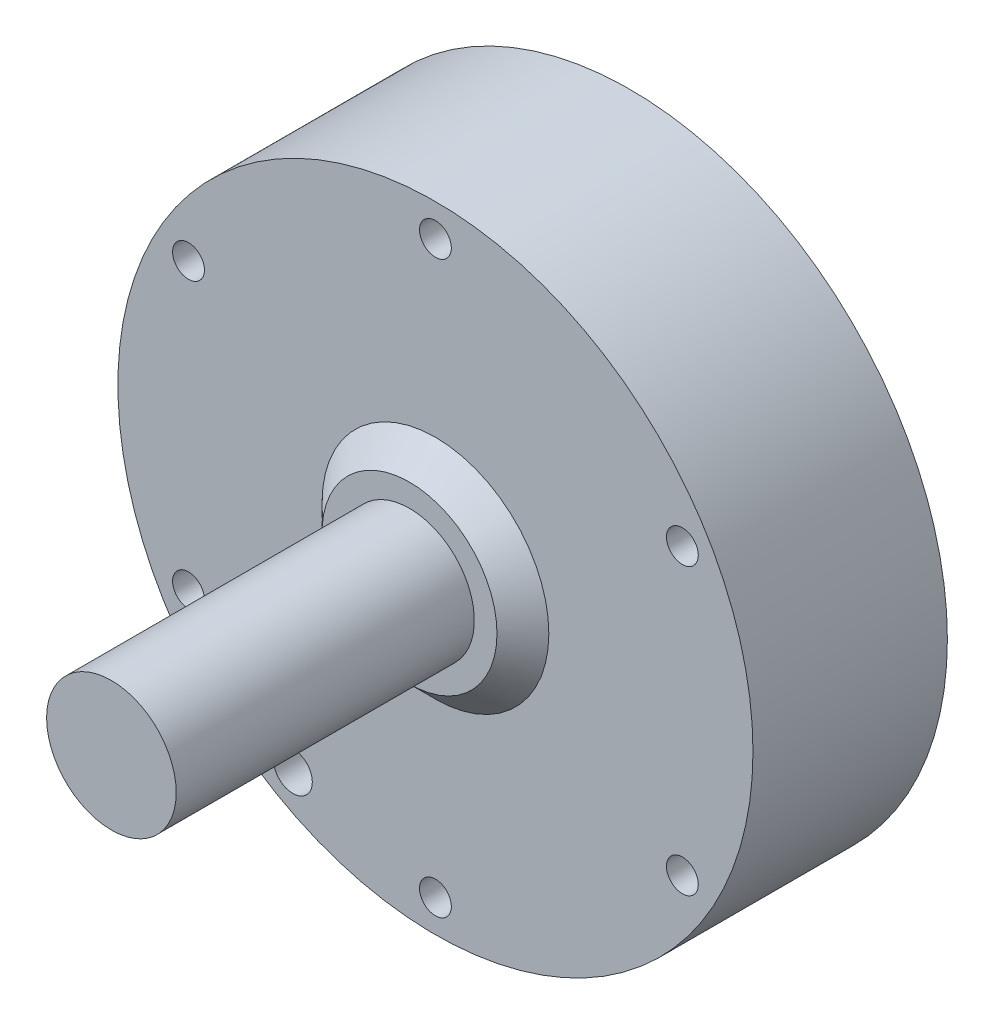
ISO-10303-21;
HEADER;
FILE_DESCRIPTION(('STEP AP214'),'2;1');
FILE_NAME('part.step','',(''),(''),'','','');
FILE_SCHEMA(('AUTOMOTIVE_DESIGN { 1 0 10303 214 1 1 1 1 }'));
ENDSEC;
DATA;
#1=APPLICATION_CONTEXT('core data for automotive mechanical design processes');
#2=APPLICATION_PROTOCOL_DEFINITION('international standard','automotive_design',2000,#1);
#3=PRODUCT_CONTEXT('',#1,'mechanical');
#4=PRODUCT('Part','Part','',(#3));
#5=PRODUCT_RELATED_PRODUCT_CATEGORY('part','',(#4));
#6=PRODUCT_DEFINITION_FORMATION('','',#4);
#7=PRODUCT_DEFINITION_CONTEXT('part definition',#1,'design');
#8=PRODUCT_DEFINITION('design','',#6,#7);
#9=PRODUCT_DEFINITION_SHAPE('','',#8);
#10=(LENGTH_UNIT() NAMED_UNIT(*) SI_UNIT(.MILLI.,.METRE.));
#11=(NAMED_UNIT(*) PLANE_ANGLE_UNIT() SI_UNIT($,.RADIAN.));
#12=(NAMED_UNIT(*) SI_UNIT($,.STERADIAN.) SOLID_ANGLE_UNIT());
#13=UNCERTAINTY_MEASURE_WITH_UNIT(LENGTH_MEASURE(1.E-05),#10,'distance_accuracy_value','');
#14=(GEOMETRIC_REPRESENTATION_CONTEXT(3) GLOBAL_UNCERTAINTY_ASSIGNED_CONTEXT((#13)) GLOBAL_UNIT_ASSIGNED_CONTEXT((#10,
#11,#12)) REPRESENTATION_CONTEXT('',''));
#15=CARTESIAN_POINT('',(0.,0.,0.));
#16=DIRECTION('',(0.,0.,1.));
#17=DIRECTION('',(1.,0.,0.));
#18=AXIS2_PLACEMENT_3D('',#15,#16,#17);
#19=CARTESIAN_POINT('',(0.,0.,30.));
#20=DIRECTION('',(0.,0.,1.));
#21=DIRECTION('',(1.,0.,0.));
#22=AXIS2_PLACEMENT_3D('',#19,#20,#21);
#23=PLANE('',#22);
#24=CARTESIAN_POINT('',(38.1051177665155,21.9999999999996,30.));
#25=DIRECTION('',(0.,0.,1.));
#26=DIRECTION('',(1.,0.,0.));
#27=AXIS2_PLACEMENT_3D('',#24,#25,#26);
#28=CIRCLE('',#27,2.455);
#29=CARTESIAN_POINT('',(40.5601177665155,21.9999999999996,30.));
#30=VERTEX_POINT('',#29);
#31=EDGE_CURVE('E123',#30,#30,#28,.T.);
#32=ORIENTED_EDGE('',*,*,#31,.F.);
#33=EDGE_LOOP('',(#32));
#34=FACE_BOUND('',#33,.T.);
#35=CARTESIAN_POINT('',(-38.1051177665152,22.0000000000002,30.));
#36=DIRECTION('',(0.,0.,1.));
#37=DIRECTION('',(1.,0.,0.));
#38=AXIS2_PLACEMENT_3D('',#35,#36,#37);
#39=CIRCLE('',#38,2.455);
#40=CARTESIAN_POINT('',(-35.6501177665152,22.0000000000002,30.));
#41=VERTEX_POINT('',#40);
#42=EDGE_CURVE('E135',#41,#41,#39,.T.);
#43=ORIENTED_EDGE('',*,*,#42,.F.);
#44=EDGE_LOOP('',(#43));
#45=FACE_BOUND('',#44,.T.);
#46=CARTESIAN_POINT('',(0.,-44.,30.));
#47=DIRECTION('',(0.,0.,1.));
#48=DIRECTION('',(1.,0.,0.));
#49=AXIS2_PLACEMENT_3D('',#46,#47,#48);
#50=CIRCLE('',#49,2.455);
#51=CARTESIAN_POINT('',(2.45499999999999,-44.,30.));
#52=VERTEX_POINT('',#51);
#53=EDGE_CURVE('E147',#52,#52,#50,.T.);
#54=ORIENTED_EDGE('',*,*,#53,.F.);
#55=EDGE_LOOP('',(#54));
#56=FACE_BOUND('',#55,.T.);
#57=CARTESIAN_POINT('',(-22.,-38.1051177665153,30.));
#58=DIRECTION('',(0.,0.,1.));
#59=DIRECTION('',(1.,0.,0.));
#60=AXIS2_PLACEMENT_3D('',#57,#58,#59);
#61=CIRCLE('',#60,3.);
#62=CARTESIAN_POINT('',(-19.0000000000001,-38.1051177665153,30.));
#63=VERTEX_POINT('',#62);
#64=EDGE_CURVE('E153',#63,#63,#61,.T.);
#65=ORIENTED_EDGE('',*,*,#64,.F.);
#66=EDGE_LOOP('',(#65));
#67=FACE_BOUND('',#66,.T.);
#68=CARTESIAN_POINT('',(0.,0.,30.));
#69=DIRECTION('',(0.,0.,1.));
#70=DIRECTION('',(1.,0.,0.));
#71=AXIS2_PLACEMENT_3D('',#68,#69,#70);
#72=CIRCLE('',#71,49.);
#73=CARTESIAN_POINT('',(49.,0.,30.));
#74=VERTEX_POINT('',#73);
#75=EDGE_CURVE('E172',#74,#74,#72,.T.);
#76=ORIENTED_EDGE('',*,*,#75,.T.);
#77=EDGE_LOOP('',(#76));
#78=FACE_BOUND('',#77,.T.);
#79=CARTESIAN_POINT('',(0.,0.,30.));
#80=DIRECTION('',(0.,0.,1.));
#81=DIRECTION('',(1.,0.,0.));
#82=AXIS2_PLACEMENT_3D('',#79,#80,#81);
#83=CIRCLE('',#82,17.5);
#84=CARTESIAN_POINT('',(17.5,0.,30.));
#85=VERTEX_POINT('',#84);
#86=EDGE_CURVE('E168',#85,#85,#83,.T.);
#87=ORIENTED_EDGE('',*,*,#86,.F.);
#88=EDGE_LOOP('',(#87));
#89=FACE_BOUND('',#88,.T.);
#90=CARTESIAN_POINT('',(-38.1051177665154,-21.9999999999999,30.));
#91=DIRECTION('',(0.,0.,1.));
#92=DIRECTION('',(1.,0.,0.));
#93=AXIS2_PLACEMENT_3D('',#90,#91,#92);
#94=CIRCLE('',#93,2.455);
#95=CARTESIAN_POINT('',(-35.6501177665154,-21.9999999999999,30.));
#96=VERTEX_POINT('',#95);
#97=EDGE_CURVE('E141',#96,#96,#94,.T.);
#98=ORIENTED_EDGE('',*,*,#97,.F.);
#99=EDGE_LOOP('',(#98));
#100=FACE_BOUND('',#99,.T.);
#101=CARTESIAN_POINT('',(3.14577829780722E-13,44.,30.));
#102=DIRECTION('',(0.,0.,1.));
#103=DIRECTION('',(1.,0.,0.));
#104=AXIS2_PLACEMENT_3D('',#101,#102,#103);
#105=CIRCLE('',#104,2.455);
#106=CARTESIAN_POINT('',(2.45500000000031,44.,30.));
#107=VERTEX_POINT('',#106);
#108=EDGE_CURVE('E129',#107,#107,#105,.T.);
#109=ORIENTED_EDGE('',*,*,#108,.F.);
#110=EDGE_LOOP('',(#109));
#111=FACE_BOUND('',#110,.T.);
#112=CARTESIAN_POINT('',(38.105117766515,-22.0000000000005,30.));
#113=DIRECTION('',(0.,0.,1.));
#114=DIRECTION('',(1.,0.,0.));
#115=AXIS2_PLACEMENT_3D('',#112,#113,#114);
#116=CIRCLE('',#115,2.455);
#117=CARTESIAN_POINT('',(40.560117766515,-22.0000000000005,30.));
#118=VERTEX_POINT('',#117);
#119=EDGE_CURVE('E117',#118,#118,#116,.T.);
#120=ORIENTED_EDGE('',*,*,#119,.F.);
#121=EDGE_LOOP('',(#120));
#122=FACE_BOUND('',#121,.T.);
#123=ADVANCED_FACE('F36',(#34,#45,#56,#67,#78,#89,#100,#111,#122),#23,.T.);
#124=CARTESIAN_POINT('',(0.,13.5,34.));
#125=DIRECTION('',(0.,0.,-1.));
#126=DIRECTION('',(-1.,0.,0.));
#127=AXIS2_PLACEMENT_3D('',#124,#125,#126);
#128=PLANE('',#127);
#129=CARTESIAN_POINT('',(0.,0.,34.));
#130=DIRECTION('',(0.,0.,1.));
#131=DIRECTION('',(1.,0.,0.));
#132=AXIS2_PLACEMENT_3D('',#129,#130,#131);
#133=CIRCLE('',#132,13.5);
#134=CARTESIAN_POINT('',(13.5,0.,34.));
#135=VERTEX_POINT('',#134);
#136=EDGE_CURVE('E165',#135,#135,#133,.T.);
#137=ORIENTED_EDGE('',*,*,#136,.T.);
#138=EDGE_LOOP('',(#137));
#139=FACE_BOUND('',#138,.T.);
#140=CARTESIAN_POINT('',(0.,0.,34.));
#141=DIRECTION('',(0.,0.,-1.));
#142=DIRECTION('',(-1.,0.,0.));
#143=AXIS2_PLACEMENT_3D('',#140,#141,#142);
#144=CIRCLE('',#143,10.);
#145=CARTESIAN_POINT('',(-10.,0.,34.));
#146=VERTEX_POINT('',#145);
#147=EDGE_CURVE('E11',#146,#146,#144,.F.);
#148=ORIENTED_EDGE('',*,*,#147,.F.);
#149=EDGE_LOOP('',(#148));
#150=FACE_BOUND('',#149,.T.);
#151=ADVANCED_FACE('F189',(#139,#150),#128,.F.);
#152=CARTESIAN_POINT('',(0.,0.,30.));
#153=DIRECTION('',(0.,0.,-1.));
#154=DIRECTION('',(-1.,0.,0.));
#155=AXIS2_PLACEMENT_3D('',#152,#153,#154);
#156=CYLINDRICAL_SURFACE('',#155,49.);
#157=CARTESIAN_POINT('',(-49.,0.,21.));
#158=CARTESIAN_POINT('',(-48.9999987782611,-0.168342132239242,20.9999925903546));
#159=CARTESIAN_POINT('',(-48.9991231981665,-0.336802306195177,20.9857828521781));
#160=CARTESIAN_POINT('',(-48.9957145124218,-0.669071574623784,20.9293010732423));
#161=CARTESIAN_POINT('',(-48.9931794749463,-0.832875015867812,20.886996325384));
#162=CARTESIAN_POINT('',(-48.9867386712462,-1.1509697533479,20.775543736485));
#163=CARTESIAN_POINT('',(-48.9828336254435,-1.3052659989282,20.706410001503));
#164=CARTESIAN_POINT('',(-48.9740920800564,-1.60002336933338,20.5432846263633));
#165=CARTESIAN_POINT('',(-48.9692557945962,-1.74048766340163,20.4492986987323));
#166=CARTESIAN_POINT('',(-48.9591876344111,-2.00383706595997,20.2389880206162));
#167=CARTESIAN_POINT('',(-48.9539552645477,-2.12669959703624,20.1226350202509));
#168=CARTESIAN_POINT('',(-48.943688885261,-2.35116484417934,19.8709510932809));
#169=CARTESIAN_POINT('',(-48.9386548841123,-2.45276667414156,19.7356193760727));
#170=CARTESIAN_POINT('',(-48.9293491416637,-2.63189536608893,19.4496925321437));
#171=CARTESIAN_POINT('',(-48.9250779923096,-2.7094035665099,19.2990856933228));
#172=CARTESIAN_POINT('',(-48.9177859887818,-2.83802538849686,18.9869659222724));
#173=CARTESIAN_POINT('',(-48.9147651216073,-2.88913928451839,18.8254531034661));
#174=CARTESIAN_POINT('',(-48.9103190415616,-2.96345914981416,18.4963228276852));
#175=CARTESIAN_POINT('',(-48.908891814127,-2.98670035647312,18.3287133552047));
#176=CARTESIAN_POINT('',(-48.9077879273528,-3.00472388165541,17.9919665455956));
#177=CARTESIAN_POINT('',(-48.9081112488621,-2.99950651151652,17.8228292252021));
#178=CARTESIAN_POINT('',(-48.9104701284996,-2.96079023817325,17.4880679480226));
#179=CARTESIAN_POINT('',(-48.9125033784114,-2.92732946025551,17.3224395633948));
#180=CARTESIAN_POINT('',(-48.9180493413292,-2.83313532919725,16.9991548213024));
#181=CARTESIAN_POINT('',(-48.9215620629073,-2.77240181803547,16.8414985100349));
#182=CARTESIAN_POINT('',(-48.9296737585873,-2.62534291212242,16.5385106805562));
#183=CARTESIAN_POINT('',(-48.9342734667511,-2.53900021292164,16.3931875817226));
#184=CARTESIAN_POINT('',(-48.9440400332174,-2.34318643121859,16.1190834190871));
#185=CARTESIAN_POINT('',(-48.9492068976297,-2.23371509955261,15.9903025335176));
#186=CARTESIAN_POINT('',(-48.9595357461034,-1.99453676722566,15.7527165848546));
#187=CARTESIAN_POINT('',(-48.9646977081483,-1.86479676908493,15.643944736669));
#188=CARTESIAN_POINT('',(-48.9744268496561,-1.58887965822355,15.4497206706382));
#189=CARTESIAN_POINT('',(-48.9789940289189,-1.44270253997375,15.3642684606375));
#190=CARTESIAN_POINT('',(-48.9870192872341,-1.13804055781479,15.2191122003982));
#191=CARTESIAN_POINT('',(-48.9904773125742,-0.979555098318889,15.1594093970617));
#192=CARTESIAN_POINT('',(-48.9958938572066,-0.654784212144267,15.067468828864));
#193=CARTESIAN_POINT('',(-48.9978523933052,-0.488498872909138,15.0352307561763));
#194=CARTESIAN_POINT('',(-49.0000470940588,-0.153136661949562,14.999175902475));
#195=CARTESIAN_POINT('',(-49.0002860418123,0.0159352549807618,14.9953131966331));
#196=CARTESIAN_POINT('',(-48.9990220406461,0.352324652623047,15.0159987466675));
#197=CARTESIAN_POINT('',(-48.9975191004198,0.519642142086703,15.0405468607525));
#198=CARTESIAN_POINT('',(-48.9929423179814,0.847643855794574,15.1173191955916));
#199=CARTESIAN_POINT('',(-48.9898696711438,1.0083330271957,15.1695223573864));
#200=CARTESIAN_POINT('',(-48.9824991874776,1.31866938728175,15.30010154663));
#201=CARTESIAN_POINT('',(-48.9782013400714,1.4683164806224,15.3784778000414));
#202=CARTESIAN_POINT('',(-48.9688565067312,1.75253112004625,15.5592953401906));
#203=CARTESIAN_POINT('',(-48.9638085686364,1.88707911273342,15.6617673116271));
#204=CARTESIAN_POINT('',(-48.9535348807093,2.13707941317929,15.8878228018194));
#205=CARTESIAN_POINT('',(-48.9483091291954,2.25253154028778,16.0114065202734));
#206=CARTESIAN_POINT('',(-48.9382607488204,2.46121830716684,16.2763754871246));
#207=CARTESIAN_POINT('',(-48.9334386659401,2.55442316192653,16.417784217407));
#208=CARTESIAN_POINT('',(-48.9247500925023,2.71576591909967,16.71427103936));
#209=CARTESIAN_POINT('',(-48.9208835962452,2.78390397102339,16.8693490494938));
#210=CARTESIAN_POINT('',(-48.9145461606989,2.89312731704894,17.1886633685796));
#211=CARTESIAN_POINT('',(-48.9120742531065,2.93423138492115,17.352893235863));
#212=CARTESIAN_POINT('',(-48.9088020649113,2.98828129316026,17.6859389442547));
#213=CARTESIAN_POINT('',(-48.9080017685169,3.00122739953276,17.8547547420247));
#214=CARTESIAN_POINT('',(-48.9081634349173,2.99859133925077,18.191884052363));
#215=CARTESIAN_POINT('',(-48.9091225049361,2.98305600222657,18.3601979344897));
#216=CARTESIAN_POINT('',(-48.9126886992029,2.92399510479369,18.691822606684));
#217=CARTESIAN_POINT('',(-48.9152958264563,2.88046949334117,18.8551333876272));
#218=CARTESIAN_POINT('',(-48.9218636280755,2.76667402075177,19.1721234119009));
#219=CARTESIAN_POINT('',(-48.925824295324,2.69640430024134,19.325802705871));
#220=CARTESIAN_POINT('',(-48.9346527620099,2.53112189857519,19.619187929208));
#221=CARTESIAN_POINT('',(-48.9395205374642,2.43610987155502,19.758894227857));
#222=CARTESIAN_POINT('',(-48.94962397496,2.22386722657035,20.0206048811718));
#223=CARTESIAN_POINT('',(-48.9548601881662,2.10660285562631,20.1425818405755));
#224=CARTESIAN_POINT('',(-48.9651058168507,1.85322764074876,20.3651606586719));
#225=CARTESIAN_POINT('',(-48.9701151764916,1.71711218994053,20.4657572771047));
#226=CARTESIAN_POINT('',(-48.9793476296826,1.42974910005197,20.6427908622421));
#227=CARTESIAN_POINT('',(-48.9835697680307,1.27848341547059,20.7191985558979));
#228=CARTESIAN_POINT('',(-48.9907390581765,0.965354874405892,20.8454388842453));
#229=CARTESIAN_POINT('',(-48.9936877038608,0.803504692350495,20.8953026726621));
#230=CARTESIAN_POINT('',(-48.9972042527984,0.533885495324568,20.9540663865922));
#231=CARTESIAN_POINT('',(-48.9982480044745,0.427859687374557,20.9712692498115));
#232=CARTESIAN_POINT('',(-48.9996462670196,0.214571907055574,20.9942384106042));
#233=CARTESIAN_POINT('',(-49.0000007787992,0.107309936320186,21.0000047232892));
#234=CARTESIAN_POINT('',(-49.,0.,21.));
#235=B_SPLINE_CURVE_WITH_KNOTS('',3,(#157,#158,#159,#160,#161,#162,#163,#164,#165,#166,#167,
#168,#169,#170,#171,#172,#173,#174,#175,#176,#177,#178,#179,#180,#181,#182,#183,#184,#185,#186,
#187,#188,#189,#190,#191,#192,#193,#194,#195,#196,#197,#198,#199,#200,#201,#202,#203,#204,#205,
#206,#207,#208,#209,#210,#211,#212,#213,#214,#215,#216,#217,#218,#219,#220,#221,#222,#223,#224,
#225,#226,#227,#228,#229,#230,#231,#232,#233,#234),.UNSPECIFIED.,.T.,.F.,(4,2,2,2,2,2,2,2,2,2,2,
2,2,2,2,2,2,2,2,2,2,2,2,2,2,2,2,2,2,2,2,2,2,2,2,2,2,2,4),(0.,0.504634654396564,1.00985781674203,
1.51481570358409,2.01965762151657,2.52514140060477,3.03064624307793,3.53654165104006,
4.04243179845081,4.54768170979437,5.05292609369829,5.55748954567153,6.0620559211797,
6.56696401827817,7.07187755500635,7.57762182785094,8.08336627081969,8.58913520145787,
9.09489846333091,9.59984297917681,10.104784974984,10.6093430155595,11.1139054122984,
11.619113857539,12.1243270818661,12.6302129469633,13.1360957946689,13.6416269596658,
14.1471533489368,14.6518492892306,15.1565461499046,15.6612403568073,16.1659212219903,
16.6713738104314,17.1769501413444,17.6831359942207,18.1887264358806,18.5104069531811,
18.8320870454309),.UNSPECIFIED.);
#236=CARTESIAN_POINT('',(-49.,0.,21.));
#237=VERTEX_POINT('',#236);
#238=EDGE_CURVE('E45',#237,#237,#235,.T.);
#239=ORIENTED_EDGE('',*,*,#238,.T.);
#240=EDGE_LOOP('',(#239));
#241=FACE_BOUND('',#240,.T.);
#242=ORIENTED_EDGE('',*,*,#75,.F.);
#243=EDGE_LOOP('',(#242));
#244=FACE_BOUND('',#243,.T.);
#245=CARTESIAN_POINT('',(0.,0.,0.));
#246=DIRECTION('',(0.,0.,1.));
#247=DIRECTION('',(1.,0.,0.));
#248=AXIS2_PLACEMENT_3D('',#245,#246,#247);
#249=CIRCLE('',#248,49.);
#250=CARTESIAN_POINT('',(49.,0.,0.));
#251=VERTEX_POINT('',#250);
#252=EDGE_CURVE('E171',#251,#251,#249,.T.);
#253=ORIENTED_EDGE('',*,*,#252,.T.);
#254=EDGE_LOOP('',(#253));
#255=FACE_BOUND('',#254,.T.);
#256=ADVANCED_FACE('F38',(#241,#244,#255),#156,.T.);
#257=CARTESIAN_POINT('',(0.,0.,0.));
#258=DIRECTION('',(0.,0.,1.));
#259=DIRECTION('',(1.,0.,0.));
#260=AXIS2_PLACEMENT_3D('',#257,#258,#259);
#261=PLANE('',#260);
#262=CARTESIAN_POINT('',(15.0439813274521,-25.9553694822894,0.));
#263=DIRECTION('',(0.,0.,-1.));
#264=DIRECTION('',(-1.,0.,0.));
#265=AXIS2_PLACEMENT_3D('',#262,#263,#264);
#266=CIRCLE('',#265,2.5);
#267=CARTESIAN_POINT('',(12.5439813274521,-25.9553694822894,0.));
#268=VERTEX_POINT('',#267);
#269=EDGE_CURVE('E88',#268,#268,#266,.T.);
#270=ORIENTED_EDGE('',*,*,#269,.F.);
#271=EDGE_LOOP('',(#270));
#272=FACE_BOUND('',#271,.T.);
#273=CARTESIAN_POINT('',(14.9560186725478,26.006154744777,0.));
#274=DIRECTION('',(0.,0.,-1.));
#275=DIRECTION('',(-1.,0.,0.));
#276=AXIS2_PLACEMENT_3D('',#273,#274,#275);
#277=CIRCLE('',#276,2.5);
#278=CARTESIAN_POINT('',(12.4560186725478,26.006154744777,0.));
#279=VERTEX_POINT('',#278);
#280=EDGE_CURVE('E96',#279,#279,#277,.T.);
#281=ORIENTED_EDGE('',*,*,#280,.F.);
#282=EDGE_LOOP('',(#281));
#283=FACE_BOUND('',#282,.T.);
#284=CARTESIAN_POINT('',(-30.,-0.0507852624878061,0.));
#285=DIRECTION('',(0.,0.,-1.));
#286=DIRECTION('',(-1.,0.,0.));
#287=AXIS2_PLACEMENT_3D('',#284,#285,#286);
#288=CIRCLE('',#287,2.5);
#289=CARTESIAN_POINT('',(-32.5,-0.0507852624878061,0.));
#290=VERTEX_POINT('',#289);
#291=EDGE_CURVE('E102',#290,#290,#288,.T.);
#292=ORIENTED_EDGE('',*,*,#291,.F.);
#293=EDGE_LOOP('',(#292));
#294=FACE_BOUND('',#293,.T.);
#295=CARTESIAN_POINT('',(29.9999722931035,0.0407726994683093,0.));
#296=DIRECTION('',(0.,0.,-1.));
#297=DIRECTION('',(0.707106781186551,0.707106781186544,0.));
#298=AXIS2_PLACEMENT_3D('',#295,#296,#297);
#299=CIRCLE('',#298,3.);
#300=CARTESIAN_POINT('',(32.1212926366632,2.16209304302794,0.));
#301=VERTEX_POINT('',#300);
#302=EDGE_CURVE('E105',#301,#301,#299,.T.);
#303=ORIENTED_EDGE('',*,*,#302,.F.);
#304=EDGE_LOOP('',(#303));
#305=FACE_BOUND('',#304,.T.);
#306=CARTESIAN_POINT('',(-21.2420144961435,21.1843531915806,0.));
#307=DIRECTION('',(0.,0.,-1.));
#308=DIRECTION('',(-1.,0.,0.));
#309=AXIS2_PLACEMENT_3D('',#306,#307,#308);
#310=CIRCLE('',#309,3.);
#311=CARTESIAN_POINT('',(-24.2420144961435,21.1843531915806,0.));
#312=VERTEX_POINT('',#311);
#313=EDGE_CURVE('E114',#312,#312,#310,.T.);
#314=ORIENTED_EDGE('',*,*,#313,.F.);
#315=EDGE_LOOP('',(#314));
#316=FACE_BOUND('',#315,.T.);
#317=CARTESIAN_POINT('',(-22.,-38.1051177665153,0.));
#318=DIRECTION('',(0.,0.,1.));
#319=DIRECTION('',(1.,0.,0.));
#320=AXIS2_PLACEMENT_3D('',#317,#318,#319);
#321=CIRCLE('',#320,3.);
#322=CARTESIAN_POINT('',(-19.0000000000001,-38.1051177665153,0.));
#323=VERTEX_POINT('',#322);
#324=EDGE_CURVE('E154',#323,#323,#321,.T.);
#325=ORIENTED_EDGE('',*,*,#324,.T.);
#326=EDGE_LOOP('',(#325));
#327=FACE_BOUND('',#326,.T.);
#328=ORIENTED_EDGE('',*,*,#252,.F.);
#329=EDGE_LOOP('',(#328));
#330=FACE_BOUND('',#329,.T.);
#331=ADVANCED_FACE('F195',(#272,#283,#294,#305,#316,#327,#330),#261,.F.);
#332=CARTESIAN_POINT('',(0.,0.,30.));
#333=DIRECTION('',(0.,0.,-1.));
#334=DIRECTION('',(-1.,0.,0.));
#335=AXIS2_PLACEMENT_3D('',#332,#333,#334);
#336=CONICAL_SURFACE('',#335,17.5,0.785398163397446);
#337=ORIENTED_EDGE('',*,*,#136,.F.);
#338=EDGE_LOOP('',(#337));
#339=FACE_BOUND('',#338,.T.);
#340=ORIENTED_EDGE('',*,*,#86,.T.);
#341=EDGE_LOOP('',(#340));
#342=FACE_BOUND('',#341,.T.);
#343=ADVANCED_FACE('F186',(#339,#342),#336,.T.);
#344=CARTESIAN_POINT('',(-37.,0.,18.));
#345=DIRECTION('',(-1.,0.,0.));
#346=DIRECTION('',(0.,0.,1.));
#347=AXIS2_PLACEMENT_3D('',#344,#345,#346);
#348=CYLINDRICAL_SURFACE('',#347,3.);
#349=CARTESIAN_POINT('',(-37.,0.,18.));
#350=DIRECTION('',(-1.,0.,0.));
#351=DIRECTION('',(0.,0.,1.));
#352=AXIS2_PLACEMENT_3D('',#349,#350,#351);
#353=CIRCLE('',#352,3.);
#354=CARTESIAN_POINT('',(-37.,0.,21.));
#355=VERTEX_POINT('',#354);
#356=EDGE_CURVE('E162',#355,#355,#353,.T.);
#357=ORIENTED_EDGE('',*,*,#356,.F.);
#358=EDGE_LOOP('',(#357));
#359=FACE_BOUND('',#358,.T.);
#360=ORIENTED_EDGE('',*,*,#238,.F.);
#361=EDGE_LOOP('',(#360));
#362=FACE_BOUND('',#361,.T.);
#363=ADVANCED_FACE('F180',(#359,#362),#348,.F.);
#364=CARTESIAN_POINT('',(-37.,0.,18.));
#365=DIRECTION('',(-1.,0.,0.));
#366=DIRECTION('',(0.,0.,1.));
#367=AXIS2_PLACEMENT_3D('',#364,#365,#366);
#368=PLANE('',#367);
#369=ORIENTED_EDGE('',*,*,#356,.T.);
#370=EDGE_LOOP('',(#369));
#371=FACE_BOUND('',#370,.T.);
#372=ADVANCED_FACE('F185',(#371),#368,.T.);
#373=CARTESIAN_POINT('',(0.,0.,80.));
#374=DIRECTION('',(0.,0.,-1.));
#375=DIRECTION('',(-1.,0.,0.));
#376=AXIS2_PLACEMENT_3D('',#373,#374,#375);
#377=CYLINDRICAL_SURFACE('',#376,10.);
#378=CARTESIAN_POINT('',(0.,0.,80.));
#379=DIRECTION('',(0.,0.,1.));
#380=DIRECTION('',(1.,0.,0.));
#381=AXIS2_PLACEMENT_3D('',#378,#379,#380);
#382=CIRCLE('',#381,10.);
#383=CARTESIAN_POINT('',(10.,0.,80.));
#384=VERTEX_POINT('',#383);
#385=EDGE_CURVE('E157',#384,#384,#382,.T.);
#386=ORIENTED_EDGE('',*,*,#385,.F.);
#387=EDGE_LOOP('',(#386));
#388=FACE_BOUND('',#387,.T.);
#389=ORIENTED_EDGE('',*,*,#147,.T.);
#390=EDGE_LOOP('',(#389));
#391=FACE_BOUND('',#390,.T.);
#392=ADVANCED_FACE('F294',(#388,#391),#377,.T.);
#393=CARTESIAN_POINT('',(0.,0.,80.));
#394=DIRECTION('',(0.,0.,1.));
#395=DIRECTION('',(1.,0.,0.));
#396=AXIS2_PLACEMENT_3D('',#393,#394,#395);
#397=PLANE('',#396);
#398=ORIENTED_EDGE('',*,*,#385,.T.);
#399=EDGE_LOOP('',(#398));
#400=FACE_BOUND('',#399,.T.);
#401=ADVANCED_FACE('F224',(#400),#397,.T.);
#402=CARTESIAN_POINT('',(-22.,-38.1051177665153,0.));
#403=DIRECTION('',(0.,0.,1.));
#404=DIRECTION('',(1.,0.,0.));
#405=AXIS2_PLACEMENT_3D('',#402,#403,#404);
#406=CYLINDRICAL_SURFACE('',#405,3.);
#407=ORIENTED_EDGE('',*,*,#324,.F.);
#408=EDGE_LOOP('',(#407));
#409=FACE_BOUND('',#408,.T.);
#410=ORIENTED_EDGE('',*,*,#64,.T.);
#411=EDGE_LOOP('',(#410));
#412=FACE_BOUND('',#411,.T.);
#413=ADVANCED_FACE('F220',(#409,#412),#406,.F.);
#414=CARTESIAN_POINT('',(0.,-44.,3.52488718028734));
#415=DIRECTION('',(0.,0.,1.));
#416=DIRECTION('',(1.,0.,0.));
#417=AXIS2_PLACEMENT_3D('',#414,#415,#416);
#418=CONICAL_SURFACE('',#417,0.,1.02974425867666);
#419=CARTESIAN_POINT('',(0.,-44.,5.));
#420=DIRECTION('',(0.,0.,1.));
#421=DIRECTION('',(1.,0.,0.));
#422=AXIS2_PLACEMENT_3D('',#419,#420,#421);
#423=CIRCLE('',#422,2.455);
#424=CARTESIAN_POINT('',(2.45499999999999,-44.,5.));
#425=VERTEX_POINT('',#424);
#426=EDGE_CURVE('E150',#425,#425,#423,.T.);
#427=ORIENTED_EDGE('',*,*,#426,.T.);
#428=EDGE_LOOP('',(#427));
#429=FACE_BOUND('',#428,.T.);
#430=CARTESIAN_POINT('',(0.,-44.,3.52488718028734));
#431=VERTEX_POINT('',#430);
#432=VERTEX_LOOP('',#431);
#433=FACE_BOUND('',#432,.T.);
#434=ADVANCED_FACE('F223',(#429,#433),#418,.F.);
#435=CARTESIAN_POINT('',(0.,-44.,30.));
#436=DIRECTION('',(0.,0.,1.));
#437=DIRECTION('',(1.,0.,0.));
#438=AXIS2_PLACEMENT_3D('',#435,#436,#437);
#439=CYLINDRICAL_SURFACE('',#438,2.455);
#440=ORIENTED_EDGE('',*,*,#53,.T.);
#441=EDGE_LOOP('',(#440));
#442=FACE_BOUND('',#441,.T.);
#443=ORIENTED_EDGE('',*,*,#426,.F.);
#444=EDGE_LOOP('',(#443));
#445=FACE_BOUND('',#444,.T.);
#446=ADVANCED_FACE('F285',(#442,#445),#439,.F.);
#447=CARTESIAN_POINT('',(-38.1051177665154,-21.9999999999999,3.52488718028734));
#448=DIRECTION('',(0.,0.,1.));
#449=DIRECTION('',(1.,0.,0.));
#450=AXIS2_PLACEMENT_3D('',#447,#448,#449);
#451=CONICAL_SURFACE('',#450,0.,1.02974425867666);
#452=CARTESIAN_POINT('',(-38.1051177665154,-21.9999999999999,5.));
#453=DIRECTION('',(0.,0.,1.));
#454=DIRECTION('',(1.,0.,0.));
#455=AXIS2_PLACEMENT_3D('',#452,#453,#454);
#456=CIRCLE('',#455,2.455);
#457=CARTESIAN_POINT('',(-35.6501177665154,-21.9999999999999,5.));
#458=VERTEX_POINT('',#457);
#459=EDGE_CURVE('E144',#458,#458,#456,.T.);
#460=ORIENTED_EDGE('',*,*,#459,.T.);
#461=EDGE_LOOP('',(#460));
#462=FACE_BOUND('',#461,.T.);
#463=CARTESIAN_POINT('',(-38.1051177665154,-21.9999999999999,3.52488718028734));
#464=VERTEX_POINT('',#463);
#465=VERTEX_LOOP('',#464);
#466=FACE_BOUND('',#465,.T.);
#467=ADVANCED_FACE('F281',(#462,#466),#451,.F.);
#468=CARTESIAN_POINT('',(-38.1051177665154,-21.9999999999999,30.));
#469=DIRECTION('',(0.,0.,1.));
#470=DIRECTION('',(1.,0.,0.));
#471=AXIS2_PLACEMENT_3D('',#468,#469,#470);
#472=CYLINDRICAL_SURFACE('',#471,2.455);
#473=ORIENTED_EDGE('',*,*,#97,.T.);
#474=EDGE_LOOP('',(#473));
#475=FACE_BOUND('',#474,.T.);
#476=ORIENTED_EDGE('',*,*,#459,.F.);
#477=EDGE_LOOP('',(#476));
#478=FACE_BOUND('',#477,.T.);
#479=ADVANCED_FACE('F277',(#475,#478),#472,.F.);
#480=CARTESIAN_POINT('',(-38.1051177665152,22.0000000000002,3.52488718028734));
#481=DIRECTION('',(0.,0.,1.));
#482=DIRECTION('',(1.,0.,0.));
#483=AXIS2_PLACEMENT_3D('',#480,#481,#482);
#484=CONICAL_SURFACE('',#483,0.,1.02974425867666);
#485=CARTESIAN_POINT('',(-38.1051177665152,22.0000000000002,5.));
#486=DIRECTION('',(0.,0.,1.));
#487=DIRECTION('',(1.,0.,0.));
#488=AXIS2_PLACEMENT_3D('',#485,#486,#487);
#489=CIRCLE('',#488,2.455);
#490=CARTESIAN_POINT('',(-35.6501177665152,22.0000000000002,5.));
#491=VERTEX_POINT('',#490);
#492=EDGE_CURVE('E138',#491,#491,#489,.T.);
#493=ORIENTED_EDGE('',*,*,#492,.T.);
#494=EDGE_LOOP('',(#493));
#495=FACE_BOUND('',#494,.T.);
#496=CARTESIAN_POINT('',(-38.1051177665152,22.0000000000002,3.52488718028734));
#497=VERTEX_POINT('',#496);
#498=VERTEX_LOOP('',#497);
#499=FACE_BOUND('',#498,.T.);
#500=ADVANCED_FACE('F273',(#495,#499),#484,.F.);
#501=CARTESIAN_POINT('',(-38.1051177665152,22.0000000000002,30.));
#502=DIRECTION('',(0.,0.,1.));
#503=DIRECTION('',(1.,0.,0.));
#504=AXIS2_PLACEMENT_3D('',#501,#502,#503);
#505=CYLINDRICAL_SURFACE('',#504,2.455);
#506=ORIENTED_EDGE('',*,*,#42,.T.);
#507=EDGE_LOOP('',(#506));
#508=FACE_BOUND('',#507,.T.);
#509=ORIENTED_EDGE('',*,*,#492,.F.);
#510=EDGE_LOOP('',(#509));
#511=FACE_BOUND('',#510,.T.);
#512=ADVANCED_FACE('F269',(#508,#511),#505,.F.);
#513=CARTESIAN_POINT('',(3.14577829780722E-13,44.,3.52488718028734));
#514=DIRECTION('',(0.,0.,1.));
#515=DIRECTION('',(1.,0.,0.));
#516=AXIS2_PLACEMENT_3D('',#513,#514,#515);
#517=CONICAL_SURFACE('',#516,0.,1.02974425867666);
#518=CARTESIAN_POINT('',(3.14577829780722E-13,44.,5.));
#519=DIRECTION('',(0.,0.,1.));
#520=DIRECTION('',(1.,0.,0.));
#521=AXIS2_PLACEMENT_3D('',#518,#519,#520);
#522=CIRCLE('',#521,2.455);
#523=CARTESIAN_POINT('',(2.45500000000031,44.,5.));
#524=VERTEX_POINT('',#523);
#525=EDGE_CURVE('E132',#524,#524,#522,.T.);
#526=ORIENTED_EDGE('',*,*,#525,.T.);
#527=EDGE_LOOP('',(#526));
#528=FACE_BOUND('',#527,.T.);
#529=CARTESIAN_POINT('',(3.14571053517144E-13,44.,3.52488718028734));
#530=VERTEX_POINT('',#529);
#531=VERTEX_LOOP('',#530);
#532=FACE_BOUND('',#531,.T.);
#533=ADVANCED_FACE('F265',(#528,#532),#517,.F.);
#534=CARTESIAN_POINT('',(3.14577829780722E-13,44.,30.));
#535=DIRECTION('',(0.,0.,1.));
#536=DIRECTION('',(1.,0.,0.));
#537=AXIS2_PLACEMENT_3D('',#534,#535,#536);
#538=CYLINDRICAL_SURFACE('',#537,2.455);
#539=ORIENTED_EDGE('',*,*,#108,.T.);
#540=EDGE_LOOP('',(#539));
#541=FACE_BOUND('',#540,.T.);
#542=ORIENTED_EDGE('',*,*,#525,.F.);
#543=EDGE_LOOP('',(#542));
#544=FACE_BOUND('',#543,.T.);
#545=ADVANCED_FACE('F261',(#541,#544),#538,.F.);
#546=CARTESIAN_POINT('',(38.1051177665155,21.9999999999996,3.52488718028734));
#547=DIRECTION('',(0.,0.,1.));
#548=DIRECTION('',(1.,0.,0.));
#549=AXIS2_PLACEMENT_3D('',#546,#547,#548);
#550=CONICAL_SURFACE('',#549,0.,1.02974425867666);
#551=CARTESIAN_POINT('',(38.1051177665155,21.9999999999996,5.));
#552=DIRECTION('',(0.,0.,1.));
#553=DIRECTION('',(1.,0.,0.));
#554=AXIS2_PLACEMENT_3D('',#551,#552,#553);
#555=CIRCLE('',#554,2.455);
#556=CARTESIAN_POINT('',(40.5601177665155,21.9999999999996,5.));
#557=VERTEX_POINT('',#556);
#558=EDGE_CURVE('E126',#557,#557,#555,.T.);
#559=ORIENTED_EDGE('',*,*,#558,.T.);
#560=EDGE_LOOP('',(#559));
#561=FACE_BOUND('',#560,.T.);
#562=CARTESIAN_POINT('',(38.1051177665155,21.9999999999996,3.52488718028734));
#563=VERTEX_POINT('',#562);
#564=VERTEX_LOOP('',#563);
#565=FACE_BOUND('',#564,.T.);
#566=ADVANCED_FACE('F254',(#561,#565),#550,.F.);
#567=CARTESIAN_POINT('',(38.1051177665155,21.9999999999996,30.));
#568=DIRECTION('',(0.,0.,1.));
#569=DIRECTION('',(1.,0.,0.));
#570=AXIS2_PLACEMENT_3D('',#567,#568,#569);
#571=CYLINDRICAL_SURFACE('',#570,2.455);
#572=ORIENTED_EDGE('',*,*,#31,.T.);
#573=EDGE_LOOP('',(#572));
#574=FACE_BOUND('',#573,.T.);
#575=ORIENTED_EDGE('',*,*,#558,.F.);
#576=EDGE_LOOP('',(#575));
#577=FACE_BOUND('',#576,.T.);
#578=ADVANCED_FACE('F249',(#574,#577),#571,.F.);
#579=CARTESIAN_POINT('',(38.105117766515,-22.0000000000005,3.52488718028734));
#580=DIRECTION('',(0.,0.,1.));
#581=DIRECTION('',(1.,0.,0.));
#582=AXIS2_PLACEMENT_3D('',#579,#580,#581);
#583=CONICAL_SURFACE('',#582,0.,1.02974425867666);
#584=CARTESIAN_POINT('',(38.105117766515,-22.0000000000005,5.));
#585=DIRECTION('',(0.,0.,1.));
#586=DIRECTION('',(1.,0.,0.));
#587=AXIS2_PLACEMENT_3D('',#584,#585,#586);
#588=CIRCLE('',#587,2.455);
#589=CARTESIAN_POINT('',(40.560117766515,-22.0000000000005,5.));
#590=VERTEX_POINT('',#589);
#591=EDGE_CURVE('E120',#590,#590,#588,.T.);
#592=ORIENTED_EDGE('',*,*,#591,.T.);
#593=EDGE_LOOP('',(#592));
#594=FACE_BOUND('',#593,.T.);
#595=CARTESIAN_POINT('',(38.105117766515,-22.0000000000005,3.52488718028734));
#596=VERTEX_POINT('',#595);
#597=VERTEX_LOOP('',#596);
#598=FACE_BOUND('',#597,.T.);
#599=ADVANCED_FACE('F243',(#594,#598),#583,.F.);
#600=CARTESIAN_POINT('',(38.105117766515,-22.0000000000005,30.));
#601=DIRECTION('',(0.,0.,1.));
#602=DIRECTION('',(1.,0.,0.));
#603=AXIS2_PLACEMENT_3D('',#600,#601,#602);
#604=CYLINDRICAL_SURFACE('',#603,2.455);
#605=ORIENTED_EDGE('',*,*,#119,.T.);
#606=EDGE_LOOP('',(#605));
#607=FACE_BOUND('',#606,.T.);
#608=ORIENTED_EDGE('',*,*,#591,.F.);
#609=EDGE_LOOP('',(#608));
#610=FACE_BOUND('',#609,.T.);
#611=ADVANCED_FACE('F239',(#607,#610),#604,.F.);
#612=CARTESIAN_POINT('',(-21.2420144961435,21.1843531915806,0.));
#613=DIRECTION('',(0.,0.,-1.));
#614=DIRECTION('',(-1.,0.,0.));
#615=AXIS2_PLACEMENT_3D('',#612,#613,#614);
#616=CYLINDRICAL_SURFACE('',#615,3.);
#617=CARTESIAN_POINT('',(-21.2420144961435,21.1843531915806,20.));
#618=DIRECTION('',(0.,0.,-1.));
#619=DIRECTION('',(-1.,0.,0.));
#620=AXIS2_PLACEMENT_3D('',#617,#618,#619);
#621=CIRCLE('',#620,3.);
#622=CARTESIAN_POINT('',(-24.2420144961435,21.1843531915806,20.));
#623=VERTEX_POINT('',#622);
#624=EDGE_CURVE('E111',#623,#623,#621,.T.);
#625=ORIENTED_EDGE('',*,*,#624,.F.);
#626=EDGE_LOOP('',(#625));
#627=FACE_BOUND('',#626,.T.);
#628=ORIENTED_EDGE('',*,*,#313,.T.);
#629=EDGE_LOOP('',(#628));
#630=FACE_BOUND('',#629,.T.);
#631=ADVANCED_FACE('F242',(#627,#630),#616,.F.);
#632=CARTESIAN_POINT('',(-21.2420144961435,21.1843531915806,20.));
#633=DIRECTION('',(0.,0.,-1.));
#634=DIRECTION('',(-1.,0.,0.));
#635=AXIS2_PLACEMENT_3D('',#632,#633,#634);
#636=CONICAL_SURFACE('',#635,3.,1.02974425867665);
#637=CARTESIAN_POINT('',(-21.2420144961435,21.1843531915806,21.8025818570827));
#638=VERTEX_POINT('',#637);
#639=VERTEX_LOOP('',#638);
#640=FACE_BOUND('',#639,.T.);
#641=ORIENTED_EDGE('',*,*,#624,.T.);
#642=EDGE_LOOP('',(#641));
#643=FACE_BOUND('',#642,.T.);
#644=ADVANCED_FACE('F409',(#640,#643),#636,.F.);
#645=CARTESIAN_POINT('',(29.9999722931035,0.0407726994683093,0.));
#646=DIRECTION('',(0.,0.,-1.));
#647=DIRECTION('',(0.707106781186551,0.707106781186544,0.));
#648=AXIS2_PLACEMENT_3D('',#645,#646,#647);
#649=CYLINDRICAL_SURFACE('',#648,3.);
#650=CARTESIAN_POINT('',(29.9999722931035,0.0407726994683093,20.));
#651=DIRECTION('',(0.,0.,-1.));
#652=DIRECTION('',(0.707106781186551,0.707106781186544,0.));
#653=AXIS2_PLACEMENT_3D('',#650,#651,#652);
#654=CIRCLE('',#653,3.);
#655=CARTESIAN_POINT('',(32.1212926366632,2.16209304302794,20.));
#656=VERTEX_POINT('',#655);
#657=EDGE_CURVE('E108',#656,#656,#654,.T.);
#658=ORIENTED_EDGE('',*,*,#657,.F.);
#659=EDGE_LOOP('',(#658));
#660=FACE_BOUND('',#659,.T.);
#661=ORIENTED_EDGE('',*,*,#302,.T.);
#662=EDGE_LOOP('',(#661));
#663=FACE_BOUND('',#662,.T.);
#664=ADVANCED_FACE('F418',(#660,#663),#649,.F.);
#665=CARTESIAN_POINT('',(29.9999722931035,0.0407726994683093,20.));
#666=DIRECTION('',(0.,0.,-1.));
#667=DIRECTION('',(0.707106781186551,0.707106781186544,0.));
#668=AXIS2_PLACEMENT_3D('',#665,#666,#667);
#669=CONICAL_SURFACE('',#668,3.,1.02974425867665);
#670=CARTESIAN_POINT('',(29.9999722931035,0.0407726994683145,21.8025818570827));
#671=VERTEX_POINT('',#670);
#672=VERTEX_LOOP('',#671);
#673=FACE_BOUND('',#672,.T.);
#674=ORIENTED_EDGE('',*,*,#657,.T.);
#675=EDGE_LOOP('',(#674));
#676=FACE_BOUND('',#675,.T.);
#677=ADVANCED_FACE('F428',(#673,#676),#669,.F.);
#678=CARTESIAN_POINT('',(-30.,-0.0507852624878061,0.));
#679=DIRECTION('',(0.,0.,-1.));
#680=DIRECTION('',(-1.,0.,0.));
#681=AXIS2_PLACEMENT_3D('',#678,#679,#680);
#682=CYLINDRICAL_SURFACE('',#681,2.5);
#683=CARTESIAN_POINT('',(-30.,-0.0507852624878061,20.));
#684=DIRECTION('',(0.,0.,-1.));
#685=DIRECTION('',(-1.,0.,0.));
#686=AXIS2_PLACEMENT_3D('',#683,#684,#685);
#687=CIRCLE('',#686,2.5);
#688=CARTESIAN_POINT('',(-32.5,-0.0507852624878061,20.));
#689=VERTEX_POINT('',#688);
#690=EDGE_CURVE('E99',#689,#689,#687,.T.);
#691=ORIENTED_EDGE('',*,*,#690,.F.);
#692=EDGE_LOOP('',(#691));
#693=FACE_BOUND('',#692,.T.);
#694=ORIENTED_EDGE('',*,*,#291,.T.);
#695=EDGE_LOOP('',(#694));
#696=FACE_BOUND('',#695,.T.);
#697=ADVANCED_FACE('F438',(#693,#696),#682,.F.);
#698=CARTESIAN_POINT('',(-30.,-0.0507852624878061,20.));
#699=DIRECTION('',(0.,0.,-1.));
#700=DIRECTION('',(-1.,0.,0.));
#701=AXIS2_PLACEMENT_3D('',#698,#699,#700);
#702=CONICAL_SURFACE('',#701,2.5,1.02974425867665);
#703=CARTESIAN_POINT('',(-30.,-0.0507852624878061,21.5021515475689));
#704=VERTEX_POINT('',#703);
#705=VERTEX_LOOP('',#704);
#706=FACE_BOUND('',#705,.T.);
#707=ORIENTED_EDGE('',*,*,#690,.T.);
#708=EDGE_LOOP('',(#707));
#709=FACE_BOUND('',#708,.T.);
#710=ADVANCED_FACE('F449',(#706,#709),#702,.F.);
#711=CARTESIAN_POINT('',(14.9560186725478,26.006154744777,0.));
#712=DIRECTION('',(0.,0.,-1.));
#713=DIRECTION('',(-1.,0.,0.));
#714=AXIS2_PLACEMENT_3D('',#711,#712,#713);
#715=CYLINDRICAL_SURFACE('',#714,2.5);
#716=CARTESIAN_POINT('',(14.9560186725478,26.006154744777,20.));
#717=DIRECTION('',(0.,0.,-1.));
#718=DIRECTION('',(-1.,0.,0.));
#719=AXIS2_PLACEMENT_3D('',#716,#717,#718);
#720=CIRCLE('',#719,2.5);
#721=CARTESIAN_POINT('',(12.4560186725478,26.006154744777,20.));
#722=VERTEX_POINT('',#721);
#723=EDGE_CURVE('E91',#722,#722,#720,.T.);
#724=ORIENTED_EDGE('',*,*,#723,.F.);
#725=EDGE_LOOP('',(#724));
#726=FACE_BOUND('',#725,.T.);
#727=ORIENTED_EDGE('',*,*,#280,.T.);
#728=EDGE_LOOP('',(#727));
#729=FACE_BOUND('',#728,.T.);
#730=ADVANCED_FACE('F459',(#726,#729),#715,.F.);
#731=CARTESIAN_POINT('',(14.9560186725478,26.006154744777,20.));
#732=DIRECTION('',(0.,0.,-1.));
#733=DIRECTION('',(-1.,0.,0.));
#734=AXIS2_PLACEMENT_3D('',#731,#732,#733);
#735=CONICAL_SURFACE('',#734,2.5,1.02974425867665);
#736=CARTESIAN_POINT('',(14.9560186725478,26.006154744777,21.5021515475689));
#737=VERTEX_POINT('',#736);
#738=VERTEX_LOOP('',#737);
#739=FACE_BOUND('',#738,.T.);
#740=ORIENTED_EDGE('',*,*,#723,.T.);
#741=EDGE_LOOP('',(#740));
#742=FACE_BOUND('',#741,.T.);
#743=ADVANCED_FACE('F473',(#739,#742),#735,.F.);
#744=CARTESIAN_POINT('',(15.0439813274521,-25.9553694822894,0.));
#745=DIRECTION('',(0.,0.,-1.));
#746=DIRECTION('',(-1.,0.,0.));
#747=AXIS2_PLACEMENT_3D('',#744,#745,#746);
#748=CYLINDRICAL_SURFACE('',#747,2.5);
#749=CARTESIAN_POINT('',(15.0439813274521,-25.9553694822894,20.));
#750=DIRECTION('',(0.,0.,-1.));
#751=DIRECTION('',(-1.,0.,0.));
#752=AXIS2_PLACEMENT_3D('',#749,#750,#751);
#753=CIRCLE('',#752,2.5);
#754=CARTESIAN_POINT('',(12.5439813274521,-25.9553694822894,20.));
#755=VERTEX_POINT('',#754);
#756=EDGE_CURVE('E86',#755,#755,#753,.T.);
#757=ORIENTED_EDGE('',*,*,#756,.F.);
#758=EDGE_LOOP('',(#757));
#759=FACE_BOUND('',#758,.T.);
#760=ORIENTED_EDGE('',*,*,#269,.T.);
#761=EDGE_LOOP('',(#760));
#762=FACE_BOUND('',#761,.T.);
#763=ADVANCED_FACE('F82',(#759,#762),#748,.F.);
#764=CARTESIAN_POINT('',(15.0439813274521,-25.9553694822894,20.));
#765=DIRECTION('',(0.,0.,-1.));
#766=DIRECTION('',(-1.,0.,0.));
#767=AXIS2_PLACEMENT_3D('',#764,#765,#766);
#768=CONICAL_SURFACE('',#767,2.5,1.02974425867665);
#769=CARTESIAN_POINT('',(15.0439813274521,-25.9553694822894,21.5021515475689));
#770=VERTEX_POINT('',#769);
#771=VERTEX_LOOP('',#770);
#772=FACE_BOUND('',#771,.T.);
#773=ORIENTED_EDGE('',*,*,#756,.T.);
#774=EDGE_LOOP('',(#773));
#775=FACE_BOUND('',#774,.T.);
#776=ADVANCED_FACE('F79',(#772,#775),#768,.F.);
#777=CLOSED_SHELL('',(#123,#151,#256,#331,#343,#363,#372,#392,#401,#413,#434,#446,#467,#479,
#500,#512,#533,#545,#566,#578,#599,#611,#631,#644,#664,#677,#697,#710,#730,#743,#763,#776));
#778=MANIFOLD_SOLID_BREP('B2',#777);
#779=ADVANCED_BREP_SHAPE_REPRESENTATION('',(#18,#778),#14);
#780=SHAPE_DEFINITION_REPRESENTATION(#9,#779);
ENDSEC;
END-ISO-10303-21;
